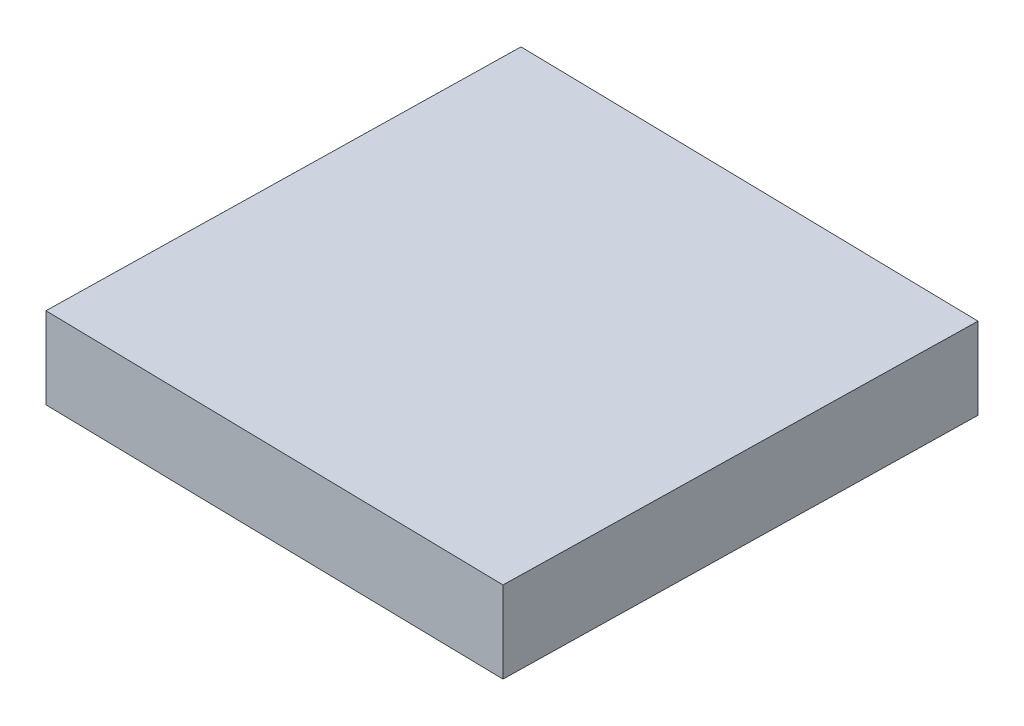
ISO-10303-21;
HEADER;
FILE_DESCRIPTION(('STEP AP214'),'2;1');
FILE_NAME('part.step','',(''),(''),'','','');
FILE_SCHEMA(('AUTOMOTIVE_DESIGN { 1 0 10303 214 1 1 1 1 }'));
ENDSEC;
DATA;
#1=APPLICATION_CONTEXT('core data for automotive mechanical design processes');
#2=APPLICATION_PROTOCOL_DEFINITION('international standard','automotive_design',2000,#1);
#3=PRODUCT_CONTEXT('',#1,'mechanical');
#4=PRODUCT('Part','Part','',(#3));
#5=PRODUCT_RELATED_PRODUCT_CATEGORY('part','',(#4));
#6=PRODUCT_DEFINITION_FORMATION('','',#4);
#7=PRODUCT_DEFINITION_CONTEXT('part definition',#1,'design');
#8=PRODUCT_DEFINITION('design','',#6,#7);
#9=PRODUCT_DEFINITION_SHAPE('','',#8);
#10=(LENGTH_UNIT() NAMED_UNIT(*) SI_UNIT(.MILLI.,.METRE.));
#11=(NAMED_UNIT(*) PLANE_ANGLE_UNIT() SI_UNIT($,.RADIAN.));
#12=(NAMED_UNIT(*) SI_UNIT($,.STERADIAN.) SOLID_ANGLE_UNIT());
#13=UNCERTAINTY_MEASURE_WITH_UNIT(LENGTH_MEASURE(1.E-05),#10,'distance_accuracy_value','');
#14=(GEOMETRIC_REPRESENTATION_CONTEXT(3) GLOBAL_UNCERTAINTY_ASSIGNED_CONTEXT((#13)) GLOBAL_UNIT_ASSIGNED_CONTEXT((#10,
#11,#12)) REPRESENTATION_CONTEXT('',''));
#15=CARTESIAN_POINT('',(0.,0.,0.));
#16=DIRECTION('',(0.,0.,1.));
#17=DIRECTION('',(1.,0.,0.));
#18=AXIS2_PLACEMENT_3D('',#15,#16,#17);
#19=CARTESIAN_POINT('',(-0.373301638481089,7.66960732929217,31.9474235124736));
#20=DIRECTION('',(0.,1.,0.));
#21=DIRECTION('',(1.,0.,0.));
#22=AXIS2_PLACEMENT_3D('',#19,#20,#21);
#23=PLANE('',#22);
#24=DIRECTION('',(0.999812677663925,0.,0.0193548335692299));
#25=VECTOR('',#24,1.);
#26=CARTESIAN_POINT('',(-2.86366456248162,7.66960732929222,29.3587380339414));
#27=LINE('',#26,#25);
#28=CARTESIAN_POINT('',(2.21538384005113,7.66960732929224,29.4570605884731));
#29=VERTEX_POINT('',#28);
#30=CARTESIAN_POINT('',(-2.86366456248162,7.6696073292921,29.3587380339414));
#31=VERTEX_POINT('',#30);
#32=EDGE_CURVE('E54',#29,#31,#27,.F.);
#33=ORIENTED_EDGE('',*,*,#32,.T.);
#34=DIRECTION('',(0.0193548335692301,0.,-0.999812677663925));
#35=VECTOR('',#34,1.);
#36=CARTESIAN_POINT('',(-2.9619871170133,7.66960732929206,34.4377864364742));
#37=LINE('',#36,#35);
#38=CARTESIAN_POINT('',(-2.9619871170133,7.6696073292921,34.4377864364742));
#39=VERTEX_POINT('',#38);
#40=EDGE_CURVE('E70',#31,#39,#37,.F.);
#41=ORIENTED_EDGE('',*,*,#40,.T.);
#42=DIRECTION('',(-0.999812677663925,0.,-0.0193548335692299));
#43=VECTOR('',#42,1.);
#44=CARTESIAN_POINT('',(-2.9619871170133,7.66960732929212,34.4377864364742));
#45=LINE('',#44,#43);
#46=CARTESIAN_POINT('',(2.11706128551944,7.66960732929224,34.5361089910059));
#47=VERTEX_POINT('',#46);
#48=EDGE_CURVE('E20',#39,#47,#45,.F.);
#49=ORIENTED_EDGE('',*,*,#48,.T.);
#50=DIRECTION('',(-0.0193548335692301,0.,0.999812677663925));
#51=VECTOR('',#50,1.);
#52=CARTESIAN_POINT('',(2.11706128551944,7.66960732929229,34.5361089910059));
#53=LINE('',#52,#51);
#54=EDGE_CURVE('E59',#47,#29,#53,.F.);
#55=ORIENTED_EDGE('',*,*,#54,.T.);
#56=EDGE_LOOP('',(#33,#41,#49,#55));
#57=FACE_BOUND('',#56,.T.);
#58=ADVANCED_FACE('F17',(#57),#23,.T.);
#59=CARTESIAN_POINT('',(-2.9619871170133,7.66960732929212,34.4377864364742));
#60=DIRECTION('',(0.0193548335692299,0.,-0.999812677663925));
#61=DIRECTION('',(-0.999812677663925,0.,-0.0193548335692299));
#62=AXIS2_PLACEMENT_3D('',#59,#60,#61);
#63=PLANE('',#62);
#64=DIRECTION('',(0.999812677663925,0.,0.0193548335692301));
#65=VECTOR('',#64,1.);
#66=CARTESIAN_POINT('',(-2.96198711701328,6.78060732929212,34.4377864364742));
#67=LINE('',#66,#65);
#68=CARTESIAN_POINT('',(-2.96198711701328,6.78060732929221,34.4377864364742));
#69=VERTEX_POINT('',#68);
#70=CARTESIAN_POINT('',(2.11706128551945,6.78060732929227,34.5361089910059));
#71=VERTEX_POINT('',#70);
#72=EDGE_CURVE('E77',#69,#71,#67,.T.);
#73=ORIENTED_EDGE('',*,*,#72,.T.);
#74=DIRECTION('',(0.,1.,0.));
#75=VECTOR('',#74,1.);
#76=CARTESIAN_POINT('',(2.11706128551944,7.66960732929229,34.5361089910059));
#77=LINE('',#76,#75);
#78=EDGE_CURVE('E64',#71,#47,#77,.T.);
#79=ORIENTED_EDGE('',*,*,#78,.T.);
#80=ORIENTED_EDGE('',*,*,#48,.F.);
#81=DIRECTION('',(0.,1.,0.));
#82=VECTOR('',#81,1.);
#83=CARTESIAN_POINT('',(-2.9619871170133,7.66960732929212,34.4377864364742));
#84=LINE('',#83,#82);
#85=EDGE_CURVE('E89',#39,#69,#84,.F.);
#86=ORIENTED_EDGE('',*,*,#85,.T.);
#87=EDGE_LOOP('',(#73,#79,#80,#86));
#88=FACE_BOUND('',#87,.T.);
#89=ADVANCED_FACE('F76',(#88),#63,.F.);
#90=CARTESIAN_POINT('',(2.11706128551944,7.66960732929229,34.5361089910059));
#91=DIRECTION('',(-0.999812677663925,0.,-0.0193548335692301));
#92=DIRECTION('',(-0.0193548335692301,0.,0.999812677663925));
#93=AXIS2_PLACEMENT_3D('',#90,#91,#92);
#94=PLANE('',#93);
#95=DIRECTION('',(0.0193548335692301,0.,-0.999812677663925));
#96=VECTOR('',#95,1.);
#97=CARTESIAN_POINT('',(2.11706128551947,6.78060732929228,34.5361089910059));
#98=LINE('',#97,#96);
#99=CARTESIAN_POINT('',(2.21538384005115,6.78060732929218,29.4570605884731));
#100=VERTEX_POINT('',#99);
#101=EDGE_CURVE('E95',#71,#100,#98,.T.);
#102=ORIENTED_EDGE('',*,*,#101,.T.);
#103=DIRECTION('',(0.,1.,0.));
#104=VECTOR('',#103,1.);
#105=CARTESIAN_POINT('',(2.21538384005115,7.66960732929206,29.4570605884731));
#106=LINE('',#105,#104);
#107=EDGE_CURVE('E66',#100,#29,#106,.T.);
#108=ORIENTED_EDGE('',*,*,#107,.T.);
#109=ORIENTED_EDGE('',*,*,#54,.F.);
#110=ORIENTED_EDGE('',*,*,#78,.F.);
#111=EDGE_LOOP('',(#102,#108,#109,#110));
#112=FACE_BOUND('',#111,.T.);
#113=ADVANCED_FACE('F62',(#112),#94,.F.);
#114=CARTESIAN_POINT('',(-2.86366456248162,7.66960732929206,29.3587380339414));
#115=DIRECTION('',(-0.0193548335692299,0.,0.999812677663925));
#116=DIRECTION('',(0.999812677663925,0.,0.0193548335692299));
#117=AXIS2_PLACEMENT_3D('',#114,#115,#116);
#118=PLANE('',#117);
#119=DIRECTION('',(-0.999812677663925,0.,-0.0193548335692302));
#120=VECTOR('',#119,1.);
#121=CARTESIAN_POINT('',(2.21538384005115,6.78060732929222,29.4570605884731));
#122=LINE('',#121,#120);
#123=CARTESIAN_POINT('',(-2.8636645624816,6.78060732929207,29.3587380339414));
#124=VERTEX_POINT('',#123);
#125=EDGE_CURVE('E27',#100,#124,#122,.T.);
#126=ORIENTED_EDGE('',*,*,#125,.T.);
#127=DIRECTION('',(0.,1.,0.));
#128=VECTOR('',#127,1.);
#129=CARTESIAN_POINT('',(-2.86366456248162,7.66960732929212,29.3587380339414));
#130=LINE('',#129,#128);
#131=EDGE_CURVE('E35',#124,#31,#130,.T.);
#132=ORIENTED_EDGE('',*,*,#131,.T.);
#133=ORIENTED_EDGE('',*,*,#32,.F.);
#134=ORIENTED_EDGE('',*,*,#107,.F.);
#135=EDGE_LOOP('',(#126,#132,#133,#134));
#136=FACE_BOUND('',#135,.T.);
#137=ADVANCED_FACE('F101',(#136),#118,.F.);
#138=CARTESIAN_POINT('',(-2.9619871170133,7.66960732929212,34.4377864364742));
#139=DIRECTION('',(0.999812677663925,0.,0.0193548335692301));
#140=DIRECTION('',(0.0193548335692301,0.,-0.999812677663925));
#141=AXIS2_PLACEMENT_3D('',#138,#139,#140);
#142=PLANE('',#141);
#143=DIRECTION('',(-0.01935483356923,0.,0.999812677663925));
#144=VECTOR('',#143,1.);
#145=CARTESIAN_POINT('',(-2.86366456248158,6.78060732929206,29.3587380339414));
#146=LINE('',#145,#144);
#147=EDGE_CURVE('E11',#124,#69,#146,.T.);
#148=ORIENTED_EDGE('',*,*,#147,.T.);
#149=ORIENTED_EDGE('',*,*,#85,.F.);
#150=ORIENTED_EDGE('',*,*,#40,.F.);
#151=ORIENTED_EDGE('',*,*,#131,.F.);
#152=EDGE_LOOP('',(#148,#149,#150,#151));
#153=FACE_BOUND('',#152,.T.);
#154=ADVANCED_FACE('F104',(#153),#142,.F.);
#155=CARTESIAN_POINT('',(-0.37330163848106,6.78060732929217,31.9474235124737));
#156=DIRECTION('',(0.,1.,0.));
#157=DIRECTION('',(1.,0.,0.));
#158=AXIS2_PLACEMENT_3D('',#155,#156,#157);
#159=PLANE('',#158);
#160=ORIENTED_EDGE('',*,*,#125,.F.);
#161=ORIENTED_EDGE('',*,*,#101,.F.);
#162=ORIENTED_EDGE('',*,*,#72,.F.);
#163=ORIENTED_EDGE('',*,*,#147,.F.);
#164=EDGE_LOOP('',(#160,#161,#162,#163));
#165=FACE_BOUND('',#164,.T.);
#166=ADVANCED_FACE('F103',(#165),#159,.F.);
#167=CLOSED_SHELL('',(#58,#89,#113,#137,#154,#166));
#168=MANIFOLD_SOLID_BREP('B1',#167);
#169=ADVANCED_BREP_SHAPE_REPRESENTATION('',(#18,#168),#14);
#170=SHAPE_DEFINITION_REPRESENTATION(#9,#169);
ENDSEC;
END-ISO-10303-21;
